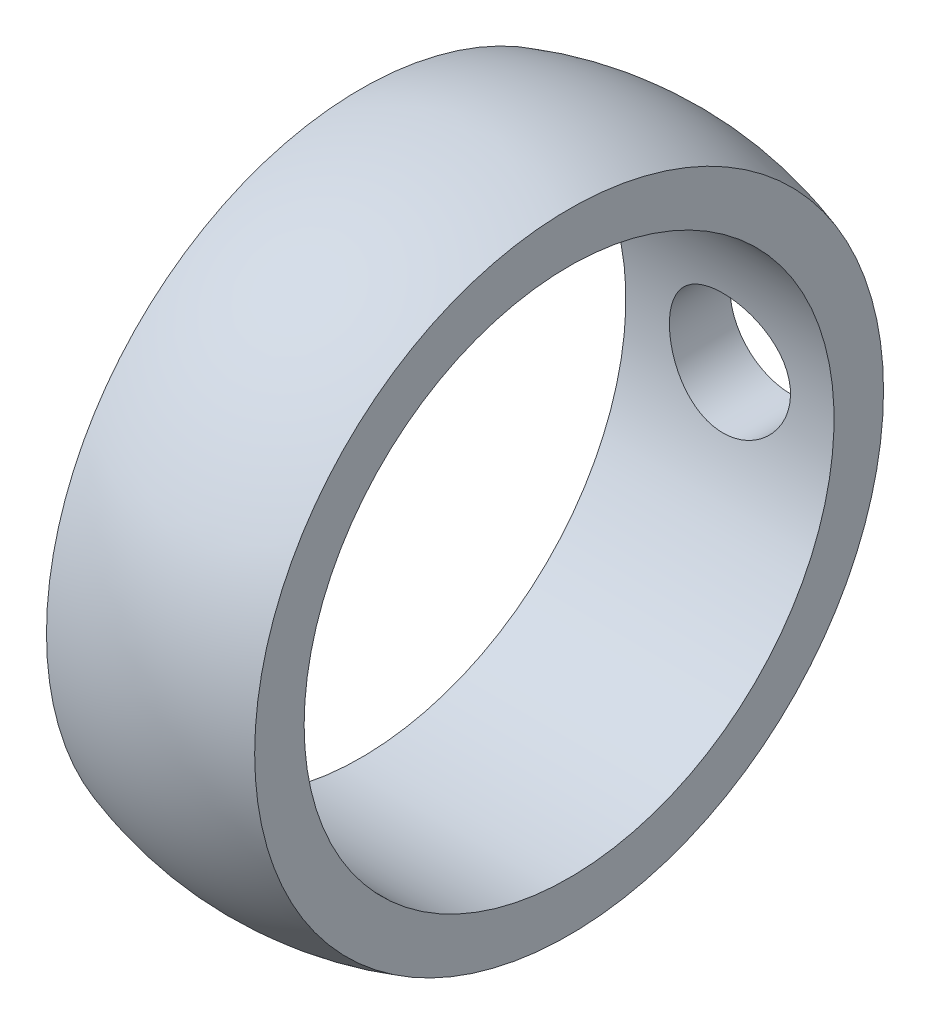
ISO-10303-21;
HEADER;
FILE_DESCRIPTION(('STEP AP214'),'2;1');
FILE_NAME('part.step','',(''),(''),'','','');
FILE_SCHEMA(('AUTOMOTIVE_DESIGN { 1 0 10303 214 1 1 1 1 }'));
ENDSEC;
DATA;
#1=APPLICATION_CONTEXT('core data for automotive mechanical design processes');
#2=APPLICATION_PROTOCOL_DEFINITION('international standard','automotive_design',2000,#1);
#3=PRODUCT_CONTEXT('',#1,'mechanical');
#4=PRODUCT('Part','Part','',(#3));
#5=PRODUCT_RELATED_PRODUCT_CATEGORY('part','',(#4));
#6=PRODUCT_DEFINITION_FORMATION('','',#4);
#7=PRODUCT_DEFINITION_CONTEXT('part definition',#1,'design');
#8=PRODUCT_DEFINITION('design','',#6,#7);
#9=PRODUCT_DEFINITION_SHAPE('','',#8);
#10=(LENGTH_UNIT() NAMED_UNIT(*) SI_UNIT(.MILLI.,.METRE.));
#11=(NAMED_UNIT(*) PLANE_ANGLE_UNIT() SI_UNIT($,.RADIAN.));
#12=(NAMED_UNIT(*) SI_UNIT($,.STERADIAN.) SOLID_ANGLE_UNIT());
#13=UNCERTAINTY_MEASURE_WITH_UNIT(LENGTH_MEASURE(1.E-05),#10,'distance_accuracy_value','');
#14=(GEOMETRIC_REPRESENTATION_CONTEXT(3) GLOBAL_UNCERTAINTY_ASSIGNED_CONTEXT((#13)) GLOBAL_UNIT_ASSIGNED_CONTEXT((#10,
#11,#12)) REPRESENTATION_CONTEXT('',''));
#15=CARTESIAN_POINT('',(0.,0.,0.));
#16=DIRECTION('',(0.,0.,1.));
#17=DIRECTION('',(1.,0.,0.));
#18=AXIS2_PLACEMENT_3D('',#15,#16,#17);
#19=CARTESIAN_POINT('',(129.,109.,-97.1));
#20=DIRECTION('',(-1.,0.,0.));
#21=DIRECTION('',(0.,0.,1.));
#22=AXIS2_PLACEMENT_3D('',#19,#20,#21);
#23=CYLINDRICAL_SURFACE('',#22,14.);
#24=CARTESIAN_POINT('',(123.5,109.,-97.1));
#25=DIRECTION('',(-1.,0.,0.));
#26=DIRECTION('',(0.,0.,1.));
#27=AXIS2_PLACEMENT_3D('',#24,#25,#26);
#28=CIRCLE('',#27,14.);
#29=CARTESIAN_POINT('',(123.5,109.,-83.1));
#30=VERTEX_POINT('',#29);
#31=EDGE_CURVE('E39',#30,#30,#28,.T.);
#32=ORIENTED_EDGE('',*,*,#31,.T.);
#33=EDGE_LOOP('',(#32));
#34=FACE_BOUND('',#33,.T.);
#35=CARTESIAN_POINT('',(129.,112.2,-110.729380029921));
#36=CARTESIAN_POINT('',(129.177158182688,112.199992245267,-110.729384740592));
#37=CARTESIAN_POINT('',(129.354420753795,112.185234214691,-110.732872921327));
#38=CARTESIAN_POINT('',(129.703928980904,112.126651077331,-110.746425163209));
#39=CARTESIAN_POINT('',(129.876169433643,112.082796869123,-110.756495807857));
#40=CARTESIAN_POINT('',(130.210468808901,111.967487497096,-110.782012914318));
#41=CARTESIAN_POINT('',(130.372540481541,111.896067734242,-110.797452478608));
#42=CARTESIAN_POINT('',(130.682397233749,111.727752635779,-110.831959553941));
#43=CARTESIAN_POINT('',(130.830183283921,111.630859032601,-110.851026818247));
#44=CARTESIAN_POINT('',(131.110016655835,111.41243680227,-110.891035003227));
#45=CARTESIAN_POINT('',(131.241761967781,111.290525909883,-110.912001773803));
#46=CARTESIAN_POINT('',(131.483124716091,111.026353266703,-110.953221055246));
#47=CARTESIAN_POINT('',(131.592740089698,110.884089620918,-110.973473499385));
#48=CARTESIAN_POINT('',(131.787934272926,110.581216641375,-111.011264302511));
#49=CARTESIAN_POINT('',(131.873221320121,110.420414667,-111.028768669914));
#50=CARTESIAN_POINT('',(132.01544727751,110.08629276506,-111.058798772712));
#51=CARTESIAN_POINT('',(132.072389688303,109.912974386315,-111.071325122862));
#52=CARTESIAN_POINT('',(132.155356500943,109.561877145577,-111.089805442449));
#53=CARTESIAN_POINT('',(132.181891741966,109.384224804971,-111.095867880525));
#54=CARTESIAN_POINT('',(132.204890046887,109.026893649517,-111.101113771446));
#55=CARTESIAN_POINT('',(132.20135686682,108.847215090578,-111.100298083481));
#56=CARTESIAN_POINT('',(132.164695203251,108.494459926159,-111.09196188781));
#57=CARTESIAN_POINT('',(132.132117580182,108.321322683776,-111.084566182864));
#58=CARTESIAN_POINT('',(132.039171878718,107.983039850556,-111.064044043593));
#59=CARTESIAN_POINT('',(131.978802462518,107.817894644851,-111.050917333399));
#60=CARTESIAN_POINT('',(131.831512266485,107.498778184491,-111.020210330961));
#61=CARTESIAN_POINT('',(131.744386559266,107.344904939939,-111.00259585062));
#62=CARTESIAN_POINT('',(131.546210534291,107.05376441757,-110.964838629711));
#63=CARTESIAN_POINT('',(131.435156685167,106.916499595534,-110.944695516145));
#64=CARTESIAN_POINT('',(131.189291216053,106.659192848183,-110.903550585158));
#65=CARTESIAN_POINT('',(131.053997607612,106.539612503524,-110.882539654441));
#66=CARTESIAN_POINT('',(130.765058346691,106.324746191058,-110.842452414539));
#67=CARTESIAN_POINT('',(130.61141209239,106.229461020262,-110.823376168835));
#68=CARTESIAN_POINT('',(130.289335292822,106.065658179004,-110.789291256512));
#69=CARTESIAN_POINT('',(130.120855132504,105.997234866263,-110.774296984185));
#70=CARTESIAN_POINT('',(129.774362362392,105.889815710447,-110.750267960657));
#71=CARTESIAN_POINT('',(129.596351434099,105.850814694637,-110.741232161931));
#72=CARTESIAN_POINT('',(129.240086797247,105.804077959562,-110.730357685548));
#73=CARTESIAN_POINT('',(129.061926306073,105.79566702129,-110.728363604311));
#74=CARTESIAN_POINT('',(128.706748517294,105.808514918186,-110.731377981713));
#75=CARTESIAN_POINT('',(128.529731135215,105.829771535201,-110.736385916834));
#76=CARTESIAN_POINT('',(128.184262707696,105.900763305565,-110.752692622324));
#77=CARTESIAN_POINT('',(128.015729605189,105.950120141663,-110.763907769325));
#78=CARTESIAN_POINT('',(127.689325137339,106.075499031252,-110.79128869792));
#79=CARTESIAN_POINT('',(127.53145493194,106.151523980229,-110.807455017063));
#80=CARTESIAN_POINT('',(127.227951367357,106.329548497911,-110.843254267604));
#81=CARTESIAN_POINT('',(127.082566605581,106.431960926083,-110.862940618507));
#82=CARTESIAN_POINT('',(126.810806142874,106.65931086609,-110.903422714253));
#83=CARTESIAN_POINT('',(126.684432041424,106.78425027131,-110.924218552245));
#84=CARTESIAN_POINT('',(126.451629116837,107.056169034698,-110.965091558682));
#85=CARTESIAN_POINT('',(126.345659853587,107.203546070062,-110.985145406604));
#86=CARTESIAN_POINT('',(126.159952497247,107.514426451963,-111.021837450715));
#87=CARTESIAN_POINT('',(126.08022086884,107.677933759952,-111.038474804736));
#88=CARTESIAN_POINT('',(125.944183331104,108.030240473552,-111.067576702612));
#89=CARTESIAN_POINT('',(125.890290132985,108.220016019745,-111.079595582402));
#90=CARTESIAN_POINT('',(125.818204561522,108.606544165997,-111.095805023024));
#91=CARTESIAN_POINT('',(125.800005229975,108.803295398592,-111.099997109614));
#92=CARTESIAN_POINT('',(125.799995282778,109.177419436061,-111.100002607009));
#93=CARTESIAN_POINT('',(125.814792005431,109.354800936272,-111.096597178975));
#94=CARTESIAN_POINT('',(125.873465495993,109.704400007325,-111.083361601706));
#95=CARTESIAN_POINT('',(125.917334833333,109.876618885911,-111.073533094132));
#96=CARTESIAN_POINT('',(126.032706367174,110.21096309441,-111.048537055497));
#97=CARTESIAN_POINT('',(126.104189202645,110.373095404187,-111.033373265897));
#98=CARTESIAN_POINT('',(126.272668224231,110.683089734898,-110.999336491116));
#99=CARTESIAN_POINT('',(126.369667881766,110.830949810431,-110.980463001339));
#100=CARTESIAN_POINT('',(126.588191548718,111.110728250388,-110.940705438173));
#101=CARTESIAN_POINT('',(126.71007162578,111.242364715416,-110.91979478517));
#102=CARTESIAN_POINT('',(126.974164078351,111.483540334783,-110.878499029451));
#103=CARTESIAN_POINT('',(127.11638202279,111.593073416887,-110.858114072493));
#104=CARTESIAN_POINT('',(127.419278983459,111.788223878044,-110.819906993939));
#105=CARTESIAN_POINT('',(127.580168119872,111.873522369816,-110.802120418831));
#106=CARTESIAN_POINT('',(127.914366143896,112.015674653928,-110.771541343722));
#107=CARTESIAN_POINT('',(128.087660421572,112.072561297603,-110.75874307974));
#108=CARTESIAN_POINT('',(128.384871918651,112.142758164337,-110.742722624603));
#109=CARTESIAN_POINT('',(128.506838579494,112.16418833442,-110.737746500086));
#110=CARTESIAN_POINT('',(128.752519878337,112.192811752577,-110.731073605288));
#111=CARTESIAN_POINT('',(128.87623446504,112.20000541758,-110.729376738971));
#112=CARTESIAN_POINT('',(129.,112.2,-110.729380029921));
#113=B_SPLINE_CURVE_WITH_KNOTS('',3,(#35,#36,#37,#38,#39,#40,#41,#42,#43,#44,#45,#46,#47,#48,
#49,#50,#51,#52,#53,#54,#55,#56,#57,#58,#59,#60,#61,#62,#63,#64,#65,#66,#67,#68,#69,#70,#71,#72,
#73,#74,#75,#76,#77,#78,#79,#80,#81,#82,#83,#84,#85,#86,#87,#88,#89,#90,#91,#92,#93,#94,#95,#96,
#97,#98,#99,#100,#101,#102,#103,#104,#105,#106,#107,#108,#109,#110,#111,#112),.UNSPECIFIED.,.T.,
.F.,(4,2,2,2,2,2,2,2,2,2,2,2,2,2,2,2,2,2,2,2,2,2,2,2,2,2,2,2,2,2,2,2,2,2,2,2,2,2,4),(0.,
0.53101657597674,1.06256506651276,1.59343317705844,2.1242651935381,2.66390961230541,
3.2036043087395,3.74952266990796,4.2953735927128,4.83191322810735,5.36838584193061,
5.89489512612262,6.42142975738358,6.95210219538598,7.48285300489967,8.02564936200289,
8.56846352341002,9.11316772444953,9.6577761387133,10.1902877793858,10.7227596079195,
11.248226704244,11.7737508707635,12.3080577026266,12.8424094637841,13.3876637967657,
13.9330523743838,14.5224989462311,15.111830599263,15.6433834393353,16.174800474022,
16.7058455833099,17.2369629756606,17.7762940388588,18.3157730658568,18.8620527632887,
19.4076993513832,19.7786868745742,20.1496635328432),.UNSPECIFIED.);
#114=CARTESIAN_POINT('',(129.,112.2,-110.729380029921));
#115=VERTEX_POINT('',#114);
#116=EDGE_CURVE('E18',#115,#115,#113,.T.);
#117=ORIENTED_EDGE('',*,*,#116,.T.);
#118=EDGE_LOOP('',(#117));
#119=FACE_BOUND('',#118,.T.);
#120=CARTESIAN_POINT('',(134.5,109.,-97.1));
#121=DIRECTION('',(-1.,0.,0.));
#122=DIRECTION('',(0.,0.,1.));
#123=AXIS2_PLACEMENT_3D('',#120,#121,#122);
#124=CIRCLE('',#123,14.);
#125=CARTESIAN_POINT('',(134.5,109.,-83.1));
#126=VERTEX_POINT('',#125);
#127=EDGE_CURVE('E37',#126,#126,#124,.F.);
#128=ORIENTED_EDGE('',*,*,#127,.T.);
#129=EDGE_LOOP('',(#128));
#130=FACE_BOUND('',#129,.T.);
#131=ADVANCED_FACE('F14',(#34,#119,#130),#23,.F.);
#132=CARTESIAN_POINT('',(129.,109.,-102.225));
#133=DIRECTION('',(0.,0.,-1.));
#134=DIRECTION('',(0.,1.,0.));
#135=AXIS2_PLACEMENT_3D('',#132,#133,#134);
#136=CYLINDRICAL_SURFACE('',#135,3.2);
#137=ORIENTED_EDGE('',*,*,#116,.F.);
#138=EDGE_LOOP('',(#137));
#139=FACE_BOUND('',#138,.T.);
#140=CARTESIAN_POINT('',(129.,109.,-114.304941150728));
#141=DIRECTION('',(0.,0.,-1.));
#142=DIRECTION('',(0.,1.,0.));
#143=AXIS2_PLACEMENT_3D('',#140,#141,#142);
#144=CIRCLE('',#143,3.2);
#145=CARTESIAN_POINT('',(129.,112.2,-114.304941150728));
#146=VERTEX_POINT('',#145);
#147=EDGE_CURVE('E30',#146,#146,#144,.F.);
#148=ORIENTED_EDGE('',*,*,#147,.F.);
#149=EDGE_LOOP('',(#148));
#150=FACE_BOUND('',#149,.T.);
#151=ADVANCED_FACE('F48',(#139,#150),#136,.F.);
#152=CARTESIAN_POINT('',(123.5,125.613247725836,-97.1));
#153=DIRECTION('',(1.,0.,0.));
#154=DIRECTION('',(0.,0.,-1.));
#155=AXIS2_PLACEMENT_3D('',#152,#153,#154);
#156=PLANE('',#155);
#157=ORIENTED_EDGE('',*,*,#31,.F.);
#158=EDGE_LOOP('',(#157));
#159=FACE_BOUND('',#158,.T.);
#160=CARTESIAN_POINT('',(123.5,109.,-97.1));
#161=DIRECTION('',(1.,0.,0.));
#162=DIRECTION('',(0.,0.,-1.));
#163=AXIS2_PLACEMENT_3D('',#160,#161,#162);
#164=CIRCLE('',#163,16.6132477258362);
#165=CARTESIAN_POINT('',(123.5,109.,-113.713247725836));
#166=VERTEX_POINT('',#165);
#167=EDGE_CURVE('E25',#166,#166,#164,.T.);
#168=ORIENTED_EDGE('',*,*,#167,.F.);
#169=EDGE_LOOP('',(#168));
#170=FACE_BOUND('',#169,.T.);
#171=ADVANCED_FACE('F51',(#159,#170),#156,.F.);
#172=CARTESIAN_POINT('',(134.5,123.,-97.1));
#173=DIRECTION('',(-1.,0.,0.));
#174=DIRECTION('',(0.,0.,1.));
#175=AXIS2_PLACEMENT_3D('',#172,#173,#174);
#176=PLANE('',#175);
#177=ORIENTED_EDGE('',*,*,#127,.F.);
#178=EDGE_LOOP('',(#177));
#179=FACE_BOUND('',#178,.T.);
#180=CARTESIAN_POINT('',(134.5,109.,-97.1));
#181=DIRECTION('',(1.,0.,0.));
#182=DIRECTION('',(0.,0.,-1.));
#183=AXIS2_PLACEMENT_3D('',#180,#181,#182);
#184=CIRCLE('',#183,16.6132477258362);
#185=CARTESIAN_POINT('',(134.5,109.,-113.713247725836));
#186=VERTEX_POINT('',#185);
#187=EDGE_CURVE('E10',#186,#186,#184,.F.);
#188=ORIENTED_EDGE('',*,*,#187,.F.);
#189=EDGE_LOOP('',(#188));
#190=FACE_BOUND('',#189,.T.);
#191=ADVANCED_FACE('F56',(#179,#190),#176,.F.);
#192=CARTESIAN_POINT('',(129.,109.,-97.1));
#193=DIRECTION('',(1.,0.,0.));
#194=DIRECTION('',(0.,-1.,0.));
#195=AXIS2_PLACEMENT_3D('',#192,#193,#194);
#196=SPHERICAL_SURFACE('',#195,17.5);
#197=ORIENTED_EDGE('',*,*,#167,.T.);
#198=EDGE_LOOP('',(#197));
#199=FACE_BOUND('',#198,.T.);
#200=ORIENTED_EDGE('',*,*,#147,.T.);
#201=EDGE_LOOP('',(#200));
#202=FACE_BOUND('',#201,.T.);
#203=ORIENTED_EDGE('',*,*,#187,.T.);
#204=EDGE_LOOP('',(#203));
#205=FACE_BOUND('',#204,.T.);
#206=ADVANCED_FACE('F54',(#199,#202,#205),#196,.T.);
#207=CLOSED_SHELL('',(#131,#151,#171,#191,#206));
#208=MANIFOLD_SOLID_BREP('B1',#207);
#209=ADVANCED_BREP_SHAPE_REPRESENTATION('',(#18,#208),#14);
#210=SHAPE_DEFINITION_REPRESENTATION(#9,#209);
ENDSEC;
END-ISO-10303-21;
